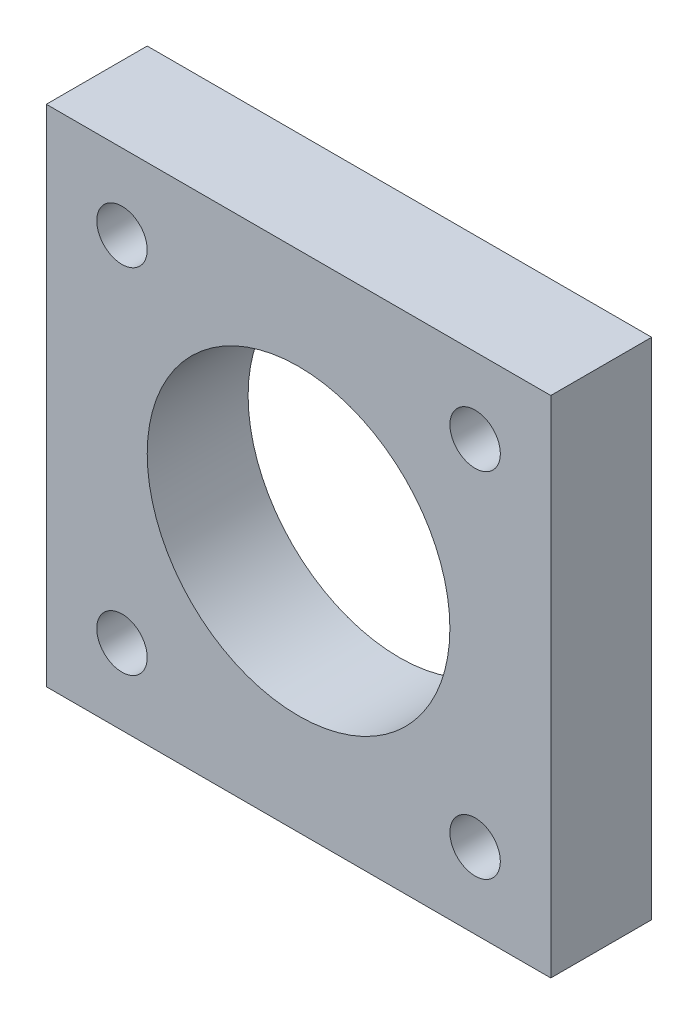
ISO-10303-21;
HEADER;
FILE_DESCRIPTION(('STEP AP214'),'2;1');
FILE_NAME('part.step','',(''),(''),'','','');
FILE_SCHEMA(('AUTOMOTIVE_DESIGN { 1 0 10303 214 1 1 1 1 }'));
ENDSEC;
DATA;
#1=APPLICATION_CONTEXT('core data for automotive mechanical design processes');
#2=APPLICATION_PROTOCOL_DEFINITION('international standard','automotive_design',2000,#1);
#3=PRODUCT_CONTEXT('',#1,'mechanical');
#4=PRODUCT('Part','Part','',(#3));
#5=PRODUCT_RELATED_PRODUCT_CATEGORY('part','',(#4));
#6=PRODUCT_DEFINITION_FORMATION('','',#4);
#7=PRODUCT_DEFINITION_CONTEXT('part definition',#1,'design');
#8=PRODUCT_DEFINITION('design','',#6,#7);
#9=PRODUCT_DEFINITION_SHAPE('','',#8);
#10=(LENGTH_UNIT() NAMED_UNIT(*) SI_UNIT(.MILLI.,.METRE.));
#11=(NAMED_UNIT(*) PLANE_ANGLE_UNIT() SI_UNIT($,.RADIAN.));
#12=(NAMED_UNIT(*) SI_UNIT($,.STERADIAN.) SOLID_ANGLE_UNIT());
#13=UNCERTAINTY_MEASURE_WITH_UNIT(LENGTH_MEASURE(1.E-05),#10,'distance_accuracy_value','');
#14=(GEOMETRIC_REPRESENTATION_CONTEXT(3) GLOBAL_UNCERTAINTY_ASSIGNED_CONTEXT((#13)) GLOBAL_UNIT_ASSIGNED_CONTEXT((#10,
#11,#12)) REPRESENTATION_CONTEXT('',''));
#15=CARTESIAN_POINT('',(0.,0.,0.));
#16=DIRECTION('',(0.,0.,1.));
#17=DIRECTION('',(1.,0.,0.));
#18=AXIS2_PLACEMENT_3D('',#15,#16,#17);
#19=CARTESIAN_POINT('',(-25.,25.,-10.));
#20=DIRECTION('',(1.,0.,0.));
#21=DIRECTION('',(0.,1.,0.));
#22=AXIS2_PLACEMENT_3D('',#19,#20,#21);
#23=PLANE('',#22);
#24=DIRECTION('',(0.,1.,0.));
#25=VECTOR('',#24,1.);
#26=CARTESIAN_POINT('',(-25.,25.,0.));
#27=LINE('',#26,#25);
#28=CARTESIAN_POINT('',(-25.,-25.,0.));
#29=VERTEX_POINT('',#28);
#30=CARTESIAN_POINT('',(-25.,25.,0.));
#31=VERTEX_POINT('',#30);
#32=EDGE_CURVE('E111',#29,#31,#27,.T.);
#33=ORIENTED_EDGE('',*,*,#32,.T.);
#34=DIRECTION('',(0.,0.,1.));
#35=VECTOR('',#34,1.);
#36=CARTESIAN_POINT('',(-25.,25.,-10.));
#37=LINE('',#36,#35);
#38=CARTESIAN_POINT('',(-25.,25.,-10.));
#39=VERTEX_POINT('',#38);
#40=EDGE_CURVE('E11',#39,#31,#37,.T.);
#41=ORIENTED_EDGE('',*,*,#40,.F.);
#42=DIRECTION('',(0.,1.,0.));
#43=VECTOR('',#42,1.);
#44=CARTESIAN_POINT('',(-25.,25.,-10.));
#45=LINE('',#44,#43);
#46=CARTESIAN_POINT('',(-25.,-25.,-10.));
#47=VERTEX_POINT('',#46);
#48=EDGE_CURVE('E95',#47,#39,#45,.T.);
#49=ORIENTED_EDGE('',*,*,#48,.F.);
#50=DIRECTION('',(0.,0.,1.));
#51=VECTOR('',#50,1.);
#52=CARTESIAN_POINT('',(-25.,-25.,-10.));
#53=LINE('',#52,#51);
#54=EDGE_CURVE('E107',#47,#29,#53,.T.);
#55=ORIENTED_EDGE('',*,*,#54,.T.);
#56=EDGE_LOOP('',(#33,#41,#49,#55));
#57=FACE_BOUND('',#56,.T.);
#58=ADVANCED_FACE('F43',(#57),#23,.F.);
#59=CARTESIAN_POINT('',(25.,25.,-10.));
#60=DIRECTION('',(0.,-1.,0.));
#61=DIRECTION('',(0.,0.,-1.));
#62=AXIS2_PLACEMENT_3D('',#59,#60,#61);
#63=PLANE('',#62);
#64=DIRECTION('',(1.,0.,0.));
#65=VECTOR('',#64,1.);
#66=CARTESIAN_POINT('',(25.,25.,0.));
#67=LINE('',#66,#65);
#68=CARTESIAN_POINT('',(25.,25.,0.));
#69=VERTEX_POINT('',#68);
#70=EDGE_CURVE('E100',#31,#69,#67,.T.);
#71=ORIENTED_EDGE('',*,*,#70,.T.);
#72=DIRECTION('',(0.,0.,1.));
#73=VECTOR('',#72,1.);
#74=CARTESIAN_POINT('',(25.,25.,-10.));
#75=LINE('',#74,#73);
#76=CARTESIAN_POINT('',(25.,25.,-10.));
#77=VERTEX_POINT('',#76);
#78=EDGE_CURVE('E52',#77,#69,#75,.T.);
#79=ORIENTED_EDGE('',*,*,#78,.F.);
#80=DIRECTION('',(1.,0.,0.));
#81=VECTOR('',#80,1.);
#82=CARTESIAN_POINT('',(25.,25.,-10.));
#83=LINE('',#82,#81);
#84=EDGE_CURVE('E90',#39,#77,#83,.T.);
#85=ORIENTED_EDGE('',*,*,#84,.F.);
#86=ORIENTED_EDGE('',*,*,#40,.T.);
#87=EDGE_LOOP('',(#71,#79,#85,#86));
#88=FACE_BOUND('',#87,.T.);
#89=ADVANCED_FACE('F99',(#88),#63,.F.);
#90=CARTESIAN_POINT('',(25.,25.,-10.));
#91=DIRECTION('',(-1.,0.,0.));
#92=DIRECTION('',(0.,-1.,0.));
#93=AXIS2_PLACEMENT_3D('',#90,#91,#92);
#94=PLANE('',#93);
#95=DIRECTION('',(0.,-1.,0.));
#96=VECTOR('',#95,1.);
#97=CARTESIAN_POINT('',(25.,25.,0.));
#98=LINE('',#97,#96);
#99=CARTESIAN_POINT('',(25.,-25.,0.));
#100=VERTEX_POINT('',#99);
#101=EDGE_CURVE('E77',#69,#100,#98,.T.);
#102=ORIENTED_EDGE('',*,*,#101,.T.);
#103=DIRECTION('',(0.,0.,1.));
#104=VECTOR('',#103,1.);
#105=CARTESIAN_POINT('',(25.,-25.,-10.));
#106=LINE('',#105,#104);
#107=CARTESIAN_POINT('',(25.,-25.,-10.));
#108=VERTEX_POINT('',#107);
#109=EDGE_CURVE('E102',#108,#100,#106,.T.);
#110=ORIENTED_EDGE('',*,*,#109,.F.);
#111=DIRECTION('',(0.,-1.,0.));
#112=VECTOR('',#111,1.);
#113=CARTESIAN_POINT('',(25.,25.,-10.));
#114=LINE('',#113,#112);
#115=EDGE_CURVE('E93',#77,#108,#114,.T.);
#116=ORIENTED_EDGE('',*,*,#115,.F.);
#117=ORIENTED_EDGE('',*,*,#78,.T.);
#118=EDGE_LOOP('',(#102,#110,#116,#117));
#119=FACE_BOUND('',#118,.T.);
#120=ADVANCED_FACE('F103',(#119),#94,.F.);
#121=CARTESIAN_POINT('',(25.,-25.,-10.));
#122=DIRECTION('',(0.,1.,0.));
#123=DIRECTION('',(0.,0.,1.));
#124=AXIS2_PLACEMENT_3D('',#121,#122,#123);
#125=PLANE('',#124);
#126=DIRECTION('',(-1.,0.,0.));
#127=VECTOR('',#126,1.);
#128=CARTESIAN_POINT('',(25.,-25.,0.));
#129=LINE('',#128,#127);
#130=EDGE_CURVE('E83',#100,#29,#129,.T.);
#131=ORIENTED_EDGE('',*,*,#130,.T.);
#132=ORIENTED_EDGE('',*,*,#54,.F.);
#133=DIRECTION('',(-1.,0.,0.));
#134=VECTOR('',#133,1.);
#135=CARTESIAN_POINT('',(25.,-25.,-10.));
#136=LINE('',#135,#134);
#137=EDGE_CURVE('E60',#108,#47,#136,.T.);
#138=ORIENTED_EDGE('',*,*,#137,.F.);
#139=ORIENTED_EDGE('',*,*,#109,.T.);
#140=EDGE_LOOP('',(#131,#132,#138,#139));
#141=FACE_BOUND('',#140,.T.);
#142=ADVANCED_FACE('F125',(#141),#125,.F.);
#143=CARTESIAN_POINT('',(0.,0.,-10.));
#144=DIRECTION('',(0.,0.,-1.));
#145=DIRECTION('',(-1.,0.,0.));
#146=AXIS2_PLACEMENT_3D('',#143,#144,#145);
#147=PLANE('',#146);
#148=CARTESIAN_POINT('',(0.,0.,-10.));
#149=DIRECTION('',(0.,0.,-1.));
#150=DIRECTION('',(-1.,0.,0.));
#151=AXIS2_PLACEMENT_3D('',#148,#149,#150);
#152=CIRCLE('',#151,15.);
#153=CARTESIAN_POINT('',(-15.,0.,-10.));
#154=VERTEX_POINT('',#153);
#155=EDGE_CURVE('E145',#154,#154,#152,.T.);
#156=ORIENTED_EDGE('',*,*,#155,.F.);
#157=EDGE_LOOP('',(#156));
#158=FACE_BOUND('',#157,.T.);
#159=CARTESIAN_POINT('',(17.5,17.5,-10.));
#160=DIRECTION('',(0.,0.,1.));
#161=DIRECTION('',(1.,0.,0.));
#162=AXIS2_PLACEMENT_3D('',#159,#160,#161);
#163=CIRCLE('',#162,2.5);
#164=CARTESIAN_POINT('',(20.,17.5,-10.));
#165=VERTEX_POINT('',#164);
#166=EDGE_CURVE('E140',#165,#165,#163,.T.);
#167=ORIENTED_EDGE('',*,*,#166,.T.);
#168=EDGE_LOOP('',(#167));
#169=FACE_BOUND('',#168,.T.);
#170=CARTESIAN_POINT('',(17.5,-17.5,-10.));
#171=DIRECTION('',(0.,0.,1.));
#172=DIRECTION('',(1.,0.,0.));
#173=AXIS2_PLACEMENT_3D('',#170,#171,#172);
#174=CIRCLE('',#173,2.5);
#175=CARTESIAN_POINT('',(20.,-17.5,-10.));
#176=VERTEX_POINT('',#175);
#177=EDGE_CURVE('E149',#176,#176,#174,.T.);
#178=ORIENTED_EDGE('',*,*,#177,.T.);
#179=EDGE_LOOP('',(#178));
#180=FACE_BOUND('',#179,.T.);
#181=CARTESIAN_POINT('',(-17.5,-17.5,-10.));
#182=DIRECTION('',(0.,0.,1.));
#183=DIRECTION('',(1.,0.,0.));
#184=AXIS2_PLACEMENT_3D('',#181,#182,#183);
#185=CIRCLE('',#184,2.5);
#186=CARTESIAN_POINT('',(-15.,-17.5,-10.));
#187=VERTEX_POINT('',#186);
#188=EDGE_CURVE('E157',#187,#187,#185,.T.);
#189=ORIENTED_EDGE('',*,*,#188,.T.);
#190=EDGE_LOOP('',(#189));
#191=FACE_BOUND('',#190,.T.);
#192=CARTESIAN_POINT('',(-17.5,17.5,-10.));
#193=DIRECTION('',(0.,0.,1.));
#194=DIRECTION('',(1.,0.,0.));
#195=AXIS2_PLACEMENT_3D('',#192,#193,#194);
#196=CIRCLE('',#195,2.5);
#197=CARTESIAN_POINT('',(-15.,17.5,-10.));
#198=VERTEX_POINT('',#197);
#199=EDGE_CURVE('E115',#198,#198,#196,.T.);
#200=ORIENTED_EDGE('',*,*,#199,.T.);
#201=EDGE_LOOP('',(#200));
#202=FACE_BOUND('',#201,.T.);
#203=ORIENTED_EDGE('',*,*,#48,.T.);
#204=ORIENTED_EDGE('',*,*,#84,.T.);
#205=ORIENTED_EDGE('',*,*,#115,.T.);
#206=ORIENTED_EDGE('',*,*,#137,.T.);
#207=EDGE_LOOP('',(#203,#204,#205,#206));
#208=FACE_BOUND('',#207,.T.);
#209=ADVANCED_FACE('F91',(#158,#169,#180,#191,#202,#208),#147,.T.);
#210=CARTESIAN_POINT('',(-17.5,17.5,-10.));
#211=DIRECTION('',(0.,0.,1.));
#212=DIRECTION('',(1.,0.,0.));
#213=AXIS2_PLACEMENT_3D('',#210,#211,#212);
#214=CYLINDRICAL_SURFACE('',#213,2.5);
#215=ORIENTED_EDGE('',*,*,#199,.F.);
#216=EDGE_LOOP('',(#215));
#217=FACE_BOUND('',#216,.T.);
#218=CARTESIAN_POINT('',(-17.5,17.5,0.));
#219=DIRECTION('',(0.,0.,1.));
#220=DIRECTION('',(1.,0.,0.));
#221=AXIS2_PLACEMENT_3D('',#218,#219,#220);
#222=CIRCLE('',#221,2.5);
#223=CARTESIAN_POINT('',(-15.,17.5,0.));
#224=VERTEX_POINT('',#223);
#225=EDGE_CURVE('E132',#224,#224,#222,.T.);
#226=ORIENTED_EDGE('',*,*,#225,.T.);
#227=EDGE_LOOP('',(#226));
#228=FACE_BOUND('',#227,.T.);
#229=ADVANCED_FACE('F186',(#217,#228),#214,.F.);
#230=CARTESIAN_POINT('',(-17.5,-17.5,-10.));
#231=DIRECTION('',(0.,0.,1.));
#232=DIRECTION('',(1.,0.,0.));
#233=AXIS2_PLACEMENT_3D('',#230,#231,#232);
#234=CYLINDRICAL_SURFACE('',#233,2.5);
#235=ORIENTED_EDGE('',*,*,#188,.F.);
#236=EDGE_LOOP('',(#235));
#237=FACE_BOUND('',#236,.T.);
#238=CARTESIAN_POINT('',(-17.5,-17.5,0.));
#239=DIRECTION('',(0.,0.,1.));
#240=DIRECTION('',(1.,0.,0.));
#241=AXIS2_PLACEMENT_3D('',#238,#239,#240);
#242=CIRCLE('',#241,2.5);
#243=CARTESIAN_POINT('',(-15.,-17.5,0.));
#244=VERTEX_POINT('',#243);
#245=EDGE_CURVE('E136',#244,#244,#242,.T.);
#246=ORIENTED_EDGE('',*,*,#245,.T.);
#247=EDGE_LOOP('',(#246));
#248=FACE_BOUND('',#247,.T.);
#249=ADVANCED_FACE('F188',(#237,#248),#234,.F.);
#250=CARTESIAN_POINT('',(17.5,-17.5,-10.));
#251=DIRECTION('',(0.,0.,1.));
#252=DIRECTION('',(1.,0.,0.));
#253=AXIS2_PLACEMENT_3D('',#250,#251,#252);
#254=CYLINDRICAL_SURFACE('',#253,2.5);
#255=ORIENTED_EDGE('',*,*,#177,.F.);
#256=EDGE_LOOP('',(#255));
#257=FACE_BOUND('',#256,.T.);
#258=CARTESIAN_POINT('',(17.5,-17.5,0.));
#259=DIRECTION('',(0.,0.,1.));
#260=DIRECTION('',(1.,0.,0.));
#261=AXIS2_PLACEMENT_3D('',#258,#259,#260);
#262=CIRCLE('',#261,2.5);
#263=CARTESIAN_POINT('',(20.,-17.5,0.));
#264=VERTEX_POINT('',#263);
#265=EDGE_CURVE('E153',#264,#264,#262,.T.);
#266=ORIENTED_EDGE('',*,*,#265,.T.);
#267=EDGE_LOOP('',(#266));
#268=FACE_BOUND('',#267,.T.);
#269=ADVANCED_FACE('F195',(#257,#268),#254,.F.);
#270=CARTESIAN_POINT('',(17.5,17.5,-10.));
#271=DIRECTION('',(0.,0.,1.));
#272=DIRECTION('',(1.,0.,0.));
#273=AXIS2_PLACEMENT_3D('',#270,#271,#272);
#274=CYLINDRICAL_SURFACE('',#273,2.5);
#275=ORIENTED_EDGE('',*,*,#166,.F.);
#276=EDGE_LOOP('',(#275));
#277=FACE_BOUND('',#276,.T.);
#278=CARTESIAN_POINT('',(17.5,17.5,0.));
#279=DIRECTION('',(0.,0.,1.));
#280=DIRECTION('',(1.,0.,0.));
#281=AXIS2_PLACEMENT_3D('',#278,#279,#280);
#282=CIRCLE('',#281,2.5);
#283=CARTESIAN_POINT('',(20.,17.5,0.));
#284=VERTEX_POINT('',#283);
#285=EDGE_CURVE('E144',#284,#284,#282,.T.);
#286=ORIENTED_EDGE('',*,*,#285,.T.);
#287=EDGE_LOOP('',(#286));
#288=FACE_BOUND('',#287,.T.);
#289=ADVANCED_FACE('F176',(#277,#288),#274,.F.);
#290=CARTESIAN_POINT('',(0.,0.,0.));
#291=DIRECTION('',(0.,0.,-1.));
#292=DIRECTION('',(-1.,0.,0.));
#293=AXIS2_PLACEMENT_3D('',#290,#291,#292);
#294=PLANE('',#293);
#295=CARTESIAN_POINT('',(0.,0.,0.));
#296=DIRECTION('',(0.,0.,1.));
#297=DIRECTION('',(1.,0.,0.));
#298=AXIS2_PLACEMENT_3D('',#295,#296,#297);
#299=CIRCLE('',#298,15.);
#300=CARTESIAN_POINT('',(15.,0.,0.));
#301=VERTEX_POINT('',#300);
#302=EDGE_CURVE('E167',#301,#301,#299,.T.);
#303=ORIENTED_EDGE('',*,*,#302,.F.);
#304=EDGE_LOOP('',(#303));
#305=FACE_BOUND('',#304,.T.);
#306=ORIENTED_EDGE('',*,*,#285,.F.);
#307=EDGE_LOOP('',(#306));
#308=FACE_BOUND('',#307,.T.);
#309=ORIENTED_EDGE('',*,*,#265,.F.);
#310=EDGE_LOOP('',(#309));
#311=FACE_BOUND('',#310,.T.);
#312=ORIENTED_EDGE('',*,*,#245,.F.);
#313=EDGE_LOOP('',(#312));
#314=FACE_BOUND('',#313,.T.);
#315=ORIENTED_EDGE('',*,*,#225,.F.);
#316=EDGE_LOOP('',(#315));
#317=FACE_BOUND('',#316,.T.);
#318=ORIENTED_EDGE('',*,*,#32,.F.);
#319=ORIENTED_EDGE('',*,*,#130,.F.);
#320=ORIENTED_EDGE('',*,*,#101,.F.);
#321=ORIENTED_EDGE('',*,*,#70,.F.);
#322=EDGE_LOOP('',(#318,#319,#320,#321));
#323=FACE_BOUND('',#322,.T.);
#324=ADVANCED_FACE('F128',(#305,#308,#311,#314,#317,#323),#294,.F.);
#325=CARTESIAN_POINT('',(0.,0.,-30.));
#326=DIRECTION('',(0.,0.,1.));
#327=DIRECTION('',(1.,0.,0.));
#328=AXIS2_PLACEMENT_3D('',#325,#326,#327);
#329=CYLINDRICAL_SURFACE('',#328,15.);
#330=ORIENTED_EDGE('',*,*,#155,.T.);
#331=EDGE_LOOP('',(#330));
#332=FACE_BOUND('',#331,.T.);
#333=ORIENTED_EDGE('',*,*,#302,.T.);
#334=EDGE_LOOP('',(#333));
#335=FACE_BOUND('',#334,.T.);
#336=ADVANCED_FACE('F172',(#332,#335),#329,.F.);
#337=CLOSED_SHELL('',(#58,#89,#120,#142,#209,#229,#249,#269,#289,#324,#336));
#338=MANIFOLD_SOLID_BREP('B2',#337);
#339=ADVANCED_BREP_SHAPE_REPRESENTATION('',(#18,#338),#14);
#340=SHAPE_DEFINITION_REPRESENTATION(#9,#339);
ENDSEC;
END-ISO-10303-21;
